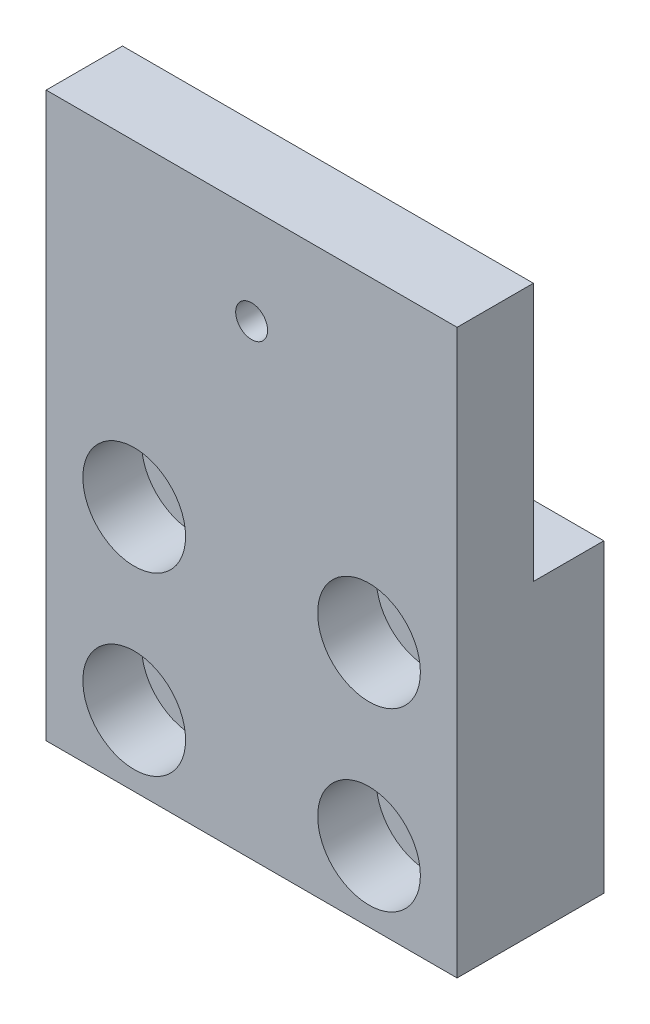
ISO-10303-21;
HEADER;
FILE_DESCRIPTION(('STEP AP214'),'2;1');
FILE_NAME('part.step','',(''),(''),'','','');
FILE_SCHEMA(('AUTOMOTIVE_DESIGN { 1 0 10303 214 1 1 1 1 }'));
ENDSEC;
DATA;
#1=APPLICATION_CONTEXT('core data for automotive mechanical design processes');
#2=APPLICATION_PROTOCOL_DEFINITION('international standard','automotive_design',2000,#1);
#3=PRODUCT_CONTEXT('',#1,'mechanical');
#4=PRODUCT('Part','Part','',(#3));
#5=PRODUCT_RELATED_PRODUCT_CATEGORY('part','',(#4));
#6=PRODUCT_DEFINITION_FORMATION('','',#4);
#7=PRODUCT_DEFINITION_CONTEXT('part definition',#1,'design');
#8=PRODUCT_DEFINITION('design','',#6,#7);
#9=PRODUCT_DEFINITION_SHAPE('','',#8);
#10=(LENGTH_UNIT() NAMED_UNIT(*) SI_UNIT(.MILLI.,.METRE.));
#11=(NAMED_UNIT(*) PLANE_ANGLE_UNIT() SI_UNIT($,.RADIAN.));
#12=(NAMED_UNIT(*) SI_UNIT($,.STERADIAN.) SOLID_ANGLE_UNIT());
#13=UNCERTAINTY_MEASURE_WITH_UNIT(LENGTH_MEASURE(1.E-05),#10,'distance_accuracy_value','');
#14=(GEOMETRIC_REPRESENTATION_CONTEXT(3) GLOBAL_UNCERTAINTY_ASSIGNED_CONTEXT((#13)) GLOBAL_UNIT_ASSIGNED_CONTEXT((#10,
#11,#12)) REPRESENTATION_CONTEXT('',''));
#15=CARTESIAN_POINT('',(0.,0.,0.));
#16=DIRECTION('',(0.,0.,1.));
#17=DIRECTION('',(1.,0.,0.));
#18=AXIS2_PLACEMENT_3D('',#15,#16,#17);
#19=CARTESIAN_POINT('',(-22.225,30.48,7.9375));
#20=DIRECTION('',(1.,0.,0.));
#21=DIRECTION('',(0.,1.,0.));
#22=AXIS2_PLACEMENT_3D('',#19,#20,#21);
#23=PLANE('',#22);
#24=DIRECTION('',(0.,-1.,0.));
#25=VECTOR('',#24,1.);
#26=CARTESIAN_POINT('',(-22.225,30.48,-0.317500000000002));
#27=LINE('',#26,#25);
#28=CARTESIAN_POINT('',(-22.225,30.48,-0.317500000000002));
#29=VERTEX_POINT('',#28);
#30=CARTESIAN_POINT('',(-22.225,2.53999999999998,-0.317500000000006));
#31=VERTEX_POINT('',#30);
#32=EDGE_CURVE('E93',#29,#31,#27,.T.);
#33=ORIENTED_EDGE('',*,*,#32,.T.);
#34=DIRECTION('',(0.,0.,-1.));
#35=VECTOR('',#34,1.);
#36=CARTESIAN_POINT('',(-22.225,2.53999999999998,-7.93750000000001));
#37=LINE('',#36,#35);
#38=CARTESIAN_POINT('',(-22.225,2.53999999999998,-7.93750000000001));
#39=VERTEX_POINT('',#38);
#40=EDGE_CURVE('E104',#31,#39,#37,.T.);
#41=ORIENTED_EDGE('',*,*,#40,.T.);
#42=DIRECTION('',(0.,-1.,0.));
#43=VECTOR('',#42,1.);
#44=CARTESIAN_POINT('',(-22.225,30.48,-7.9375));
#45=LINE('',#44,#43);
#46=CARTESIAN_POINT('',(-22.225,-30.48,-7.9375));
#47=VERTEX_POINT('',#46);
#48=EDGE_CURVE('E133',#39,#47,#45,.T.);
#49=ORIENTED_EDGE('',*,*,#48,.T.);
#50=DIRECTION('',(0.,0.,-1.));
#51=VECTOR('',#50,1.);
#52=CARTESIAN_POINT('',(-22.225,-30.48,7.9375));
#53=LINE('',#52,#51);
#54=CARTESIAN_POINT('',(-22.225,-30.48,7.9375));
#55=VERTEX_POINT('',#54);
#56=EDGE_CURVE('E11',#55,#47,#53,.T.);
#57=ORIENTED_EDGE('',*,*,#56,.F.);
#58=DIRECTION('',(0.,-1.,0.));
#59=VECTOR('',#58,1.);
#60=CARTESIAN_POINT('',(-22.225,30.48,7.9375));
#61=LINE('',#60,#59);
#62=CARTESIAN_POINT('',(-22.225,30.48,7.9375));
#63=VERTEX_POINT('',#62);
#64=EDGE_CURVE('E115',#63,#55,#61,.T.);
#65=ORIENTED_EDGE('',*,*,#64,.F.);
#66=DIRECTION('',(0.,0.,-1.));
#67=VECTOR('',#66,1.);
#68=CARTESIAN_POINT('',(-22.225,30.48,7.9375));
#69=LINE('',#68,#67);
#70=EDGE_CURVE('E109',#63,#29,#69,.T.);
#71=ORIENTED_EDGE('',*,*,#70,.T.);
#72=EDGE_LOOP('',(#33,#41,#49,#57,#65,#71));
#73=FACE_BOUND('',#72,.T.);
#74=ADVANCED_FACE('F35',(#73),#23,.F.);
#75=CARTESIAN_POINT('',(-22.225,-30.48,7.9375));
#76=DIRECTION('',(0.,1.,0.));
#77=DIRECTION('',(0.,0.,1.));
#78=AXIS2_PLACEMENT_3D('',#75,#76,#77);
#79=PLANE('',#78);
#80=DIRECTION('',(1.,0.,0.));
#81=VECTOR('',#80,1.);
#82=CARTESIAN_POINT('',(-22.225,-30.48,-7.9375));
#83=LINE('',#82,#81);
#84=CARTESIAN_POINT('',(22.225,-30.48,-7.9375));
#85=VERTEX_POINT('',#84);
#86=EDGE_CURVE('E73',#47,#85,#83,.T.);
#87=ORIENTED_EDGE('',*,*,#86,.T.);
#88=DIRECTION('',(0.,0.,-1.));
#89=VECTOR('',#88,1.);
#90=CARTESIAN_POINT('',(22.225,-30.48,7.9375));
#91=LINE('',#90,#89);
#92=CARTESIAN_POINT('',(22.225,-30.48,7.9375));
#93=VERTEX_POINT('',#92);
#94=EDGE_CURVE('E42',#93,#85,#91,.T.);
#95=ORIENTED_EDGE('',*,*,#94,.F.);
#96=DIRECTION('',(1.,0.,0.));
#97=VECTOR('',#96,1.);
#98=CARTESIAN_POINT('',(-22.225,-30.48,7.9375));
#99=LINE('',#98,#97);
#100=EDGE_CURVE('E78',#55,#93,#99,.T.);
#101=ORIENTED_EDGE('',*,*,#100,.F.);
#102=ORIENTED_EDGE('',*,*,#56,.T.);
#103=EDGE_LOOP('',(#87,#95,#101,#102));
#104=FACE_BOUND('',#103,.T.);
#105=ADVANCED_FACE('F213',(#104),#79,.F.);
#106=CARTESIAN_POINT('',(22.225,30.48,7.9375));
#107=DIRECTION('',(-1.,0.,0.));
#108=DIRECTION('',(0.,-1.,0.));
#109=AXIS2_PLACEMENT_3D('',#106,#107,#108);
#110=PLANE('',#109);
#111=DIRECTION('',(0.,1.,0.));
#112=VECTOR('',#111,1.);
#113=CARTESIAN_POINT('',(22.225,30.48,-7.9375));
#114=LINE('',#113,#112);
#115=CARTESIAN_POINT('',(22.225,2.54,-7.9375));
#116=VERTEX_POINT('',#115);
#117=EDGE_CURVE('E121',#85,#116,#114,.T.);
#118=ORIENTED_EDGE('',*,*,#117,.T.);
#119=DIRECTION('',(0.,0.,-1.));
#120=VECTOR('',#119,1.);
#121=CARTESIAN_POINT('',(22.225,2.53999999999999,-7.93750000000001));
#122=LINE('',#121,#120);
#123=CARTESIAN_POINT('',(22.225,2.53999999999999,-0.317500000000006));
#124=VERTEX_POINT('',#123);
#125=EDGE_CURVE('E49',#124,#116,#122,.T.);
#126=ORIENTED_EDGE('',*,*,#125,.F.);
#127=DIRECTION('',(0.,-1.,0.));
#128=VECTOR('',#127,1.);
#129=CARTESIAN_POINT('',(22.225,30.48,-0.317500000000002));
#130=LINE('',#129,#128);
#131=CARTESIAN_POINT('',(22.225,30.48,-0.317500000000002));
#132=VERTEX_POINT('',#131);
#133=EDGE_CURVE('E189',#132,#124,#130,.T.);
#134=ORIENTED_EDGE('',*,*,#133,.F.);
#135=DIRECTION('',(0.,0.,-1.));
#136=VECTOR('',#135,1.);
#137=CARTESIAN_POINT('',(22.225,30.48,7.9375));
#138=LINE('',#137,#136);
#139=CARTESIAN_POINT('',(22.225,30.48,7.9375));
#140=VERTEX_POINT('',#139);
#141=EDGE_CURVE('E112',#140,#132,#138,.T.);
#142=ORIENTED_EDGE('',*,*,#141,.F.);
#143=DIRECTION('',(0.,1.,0.));
#144=VECTOR('',#143,1.);
#145=CARTESIAN_POINT('',(22.225,30.48,7.9375));
#146=LINE('',#145,#144);
#147=EDGE_CURVE('E118',#93,#140,#146,.T.);
#148=ORIENTED_EDGE('',*,*,#147,.F.);
#149=ORIENTED_EDGE('',*,*,#94,.T.);
#150=EDGE_LOOP('',(#118,#126,#134,#142,#148,#149));
#151=FACE_BOUND('',#150,.T.);
#152=ADVANCED_FACE('F127',(#151),#110,.F.);
#153=CARTESIAN_POINT('',(-22.225,30.48,7.9375));
#154=DIRECTION('',(0.,-1.,0.));
#155=DIRECTION('',(0.,0.,-1.));
#156=AXIS2_PLACEMENT_3D('',#153,#154,#155);
#157=PLANE('',#156);
#158=ORIENTED_EDGE('',*,*,#141,.T.);
#159=DIRECTION('',(1.,0.,0.));
#160=VECTOR('',#159,1.);
#161=CARTESIAN_POINT('',(-22.225,30.48,-0.317500000000002));
#162=LINE('',#161,#160);
#163=EDGE_CURVE('E97',#29,#132,#162,.T.);
#164=ORIENTED_EDGE('',*,*,#163,.F.);
#165=ORIENTED_EDGE('',*,*,#70,.F.);
#166=DIRECTION('',(-1.,0.,0.));
#167=VECTOR('',#166,1.);
#168=CARTESIAN_POINT('',(-22.225,30.48,7.9375));
#169=LINE('',#168,#167);
#170=EDGE_CURVE('E58',#140,#63,#169,.T.);
#171=ORIENTED_EDGE('',*,*,#170,.F.);
#172=EDGE_LOOP('',(#158,#164,#165,#171));
#173=FACE_BOUND('',#172,.T.);
#174=ADVANCED_FACE('F108',(#173),#157,.F.);
#175=CARTESIAN_POINT('',(0.,0.,7.9375));
#176=DIRECTION('',(0.,0.,1.));
#177=DIRECTION('',(1.,0.,0.));
#178=AXIS2_PLACEMENT_3D('',#175,#176,#177);
#179=PLANE('',#178);
#180=CARTESIAN_POINT('',(0.,19.939,7.9375));
#181=DIRECTION('',(0.,0.,1.));
#182=DIRECTION('',(1.,0.,0.));
#183=AXIS2_PLACEMENT_3D('',#180,#181,#182);
#184=CIRCLE('',#183,1.72719999999999);
#185=CARTESIAN_POINT('',(1.72719999999999,19.939,7.9375));
#186=VERTEX_POINT('',#185);
#187=EDGE_CURVE('E195',#186,#186,#184,.T.);
#188=ORIENTED_EDGE('',*,*,#187,.F.);
#189=EDGE_LOOP('',(#188));
#190=FACE_BOUND('',#189,.T.);
#191=CARTESIAN_POINT('',(-12.7,-3.81,7.9375));
#192=DIRECTION('',(0.,0.,1.));
#193=DIRECTION('',(1.,0.,0.));
#194=AXIS2_PLACEMENT_3D('',#191,#192,#193);
#195=CIRCLE('',#194,5.55625);
#196=CARTESIAN_POINT('',(-7.14375,-3.81,7.9375));
#197=VERTEX_POINT('',#196);
#198=EDGE_CURVE('E183',#197,#197,#195,.T.);
#199=ORIENTED_EDGE('',*,*,#198,.F.);
#200=EDGE_LOOP('',(#199));
#201=FACE_BOUND('',#200,.T.);
#202=CARTESIAN_POINT('',(12.7,-3.81,7.9375));
#203=DIRECTION('',(0.,0.,1.));
#204=DIRECTION('',(1.,0.,0.));
#205=AXIS2_PLACEMENT_3D('',#202,#203,#204);
#206=CIRCLE('',#205,5.55625);
#207=CARTESIAN_POINT('',(18.25625,-3.81,7.9375));
#208=VERTEX_POINT('',#207);
#209=EDGE_CURVE('E171',#208,#208,#206,.T.);
#210=ORIENTED_EDGE('',*,*,#209,.F.);
#211=EDGE_LOOP('',(#210));
#212=FACE_BOUND('',#211,.T.);
#213=CARTESIAN_POINT('',(12.7,-22.86,7.9375));
#214=DIRECTION('',(0.,0.,1.));
#215=DIRECTION('',(1.,0.,0.));
#216=AXIS2_PLACEMENT_3D('',#213,#214,#215);
#217=CIRCLE('',#216,5.55625);
#218=CARTESIAN_POINT('',(18.25625,-22.86,7.9375));
#219=VERTEX_POINT('',#218);
#220=EDGE_CURVE('E159',#219,#219,#217,.T.);
#221=ORIENTED_EDGE('',*,*,#220,.F.);
#222=EDGE_LOOP('',(#221));
#223=FACE_BOUND('',#222,.T.);
#224=CARTESIAN_POINT('',(-12.7,-22.86,7.9375));
#225=DIRECTION('',(0.,0.,1.));
#226=DIRECTION('',(1.,0.,0.));
#227=AXIS2_PLACEMENT_3D('',#224,#225,#226);
#228=CIRCLE('',#227,5.55625);
#229=CARTESIAN_POINT('',(-7.14375,-22.86,7.9375));
#230=VERTEX_POINT('',#229);
#231=EDGE_CURVE('E147',#230,#230,#228,.T.);
#232=ORIENTED_EDGE('',*,*,#231,.F.);
#233=EDGE_LOOP('',(#232));
#234=FACE_BOUND('',#233,.T.);
#235=ORIENTED_EDGE('',*,*,#64,.T.);
#236=ORIENTED_EDGE('',*,*,#100,.T.);
#237=ORIENTED_EDGE('',*,*,#147,.T.);
#238=ORIENTED_EDGE('',*,*,#170,.T.);
#239=EDGE_LOOP('',(#235,#236,#237,#238));
#240=FACE_BOUND('',#239,.T.);
#241=ADVANCED_FACE('F202',(#190,#201,#212,#223,#234,#240),#179,.T.);
#242=CARTESIAN_POINT('',(0.,0.,-7.9375));
#243=DIRECTION('',(0.,0.,1.));
#244=DIRECTION('',(1.,0.,0.));
#245=AXIS2_PLACEMENT_3D('',#242,#243,#244);
#246=PLANE('',#245);
#247=CARTESIAN_POINT('',(-12.7,-3.81,-7.9375));
#248=DIRECTION('',(0.,0.,1.));
#249=DIRECTION('',(1.,0.,0.));
#250=AXIS2_PLACEMENT_3D('',#247,#248,#249);
#251=CIRCLE('',#250,3.3782);
#252=CARTESIAN_POINT('',(-9.3218,-3.81,-7.9375));
#253=VERTEX_POINT('',#252);
#254=EDGE_CURVE('E174',#253,#253,#251,.T.);
#255=ORIENTED_EDGE('',*,*,#254,.T.);
#256=EDGE_LOOP('',(#255));
#257=FACE_BOUND('',#256,.T.);
#258=CARTESIAN_POINT('',(12.7,-3.81,-7.9375));
#259=DIRECTION('',(0.,0.,1.));
#260=DIRECTION('',(1.,0.,0.));
#261=AXIS2_PLACEMENT_3D('',#258,#259,#260);
#262=CIRCLE('',#261,3.3782);
#263=CARTESIAN_POINT('',(16.0782,-3.81,-7.9375));
#264=VERTEX_POINT('',#263);
#265=EDGE_CURVE('E162',#264,#264,#262,.T.);
#266=ORIENTED_EDGE('',*,*,#265,.T.);
#267=EDGE_LOOP('',(#266));
#268=FACE_BOUND('',#267,.T.);
#269=CARTESIAN_POINT('',(12.7,-22.86,-7.9375));
#270=DIRECTION('',(0.,0.,1.));
#271=DIRECTION('',(1.,0.,0.));
#272=AXIS2_PLACEMENT_3D('',#269,#270,#271);
#273=CIRCLE('',#272,3.3782);
#274=CARTESIAN_POINT('',(16.0782,-22.86,-7.9375));
#275=VERTEX_POINT('',#274);
#276=EDGE_CURVE('E150',#275,#275,#273,.T.);
#277=ORIENTED_EDGE('',*,*,#276,.T.);
#278=EDGE_LOOP('',(#277));
#279=FACE_BOUND('',#278,.T.);
#280=CARTESIAN_POINT('',(-12.7,-22.86,-7.9375));
#281=DIRECTION('',(0.,0.,1.));
#282=DIRECTION('',(1.,0.,0.));
#283=AXIS2_PLACEMENT_3D('',#280,#281,#282);
#284=CIRCLE('',#283,3.3782);
#285=CARTESIAN_POINT('',(-9.32179999999999,-22.86,-7.9375));
#286=VERTEX_POINT('',#285);
#287=EDGE_CURVE('E134',#286,#286,#284,.T.);
#288=ORIENTED_EDGE('',*,*,#287,.T.);
#289=EDGE_LOOP('',(#288));
#290=FACE_BOUND('',#289,.T.);
#291=ORIENTED_EDGE('',*,*,#48,.F.);
#292=DIRECTION('',(1.,0.,0.));
#293=VECTOR('',#292,1.);
#294=CARTESIAN_POINT('',(-22.225,2.53999999999998,-7.93750000000001));
#295=LINE('',#294,#293);
#296=EDGE_CURVE('E131',#39,#116,#295,.T.);
#297=ORIENTED_EDGE('',*,*,#296,.T.);
#298=ORIENTED_EDGE('',*,*,#117,.F.);
#299=ORIENTED_EDGE('',*,*,#86,.F.);
#300=EDGE_LOOP('',(#291,#297,#298,#299));
#301=FACE_BOUND('',#300,.T.);
#302=ADVANCED_FACE('F130',(#257,#268,#279,#290,#301),#246,.F.);
#303=CARTESIAN_POINT('',(-12.7,-22.86,7.9375));
#304=DIRECTION('',(0.,0.,1.));
#305=DIRECTION('',(1.,0.,0.));
#306=AXIS2_PLACEMENT_3D('',#303,#304,#305);
#307=CYLINDRICAL_SURFACE('',#306,3.3782);
#308=ORIENTED_EDGE('',*,*,#287,.F.);
#309=EDGE_LOOP('',(#308));
#310=FACE_BOUND('',#309,.T.);
#311=CARTESIAN_POINT('',(-12.7,-22.86,1.5875));
#312=DIRECTION('',(0.,0.,1.));
#313=DIRECTION('',(1.,0.,0.));
#314=AXIS2_PLACEMENT_3D('',#311,#312,#313);
#315=CIRCLE('',#314,3.37820000000001);
#316=CARTESIAN_POINT('',(-9.32179999999999,-22.86,1.5875));
#317=VERTEX_POINT('',#316);
#318=EDGE_CURVE('E141',#317,#317,#315,.T.);
#319=ORIENTED_EDGE('',*,*,#318,.T.);
#320=EDGE_LOOP('',(#319));
#321=FACE_BOUND('',#320,.T.);
#322=ADVANCED_FACE('F224',(#310,#321),#307,.F.);
#323=CARTESIAN_POINT('',(-9.32179999999999,-22.86,1.5875));
#324=DIRECTION('',(0.,0.,-1.));
#325=DIRECTION('',(-1.,0.,0.));
#326=AXIS2_PLACEMENT_3D('',#323,#324,#325);
#327=PLANE('',#326);
#328=ORIENTED_EDGE('',*,*,#318,.F.);
#329=EDGE_LOOP('',(#328));
#330=FACE_BOUND('',#329,.T.);
#331=CARTESIAN_POINT('',(-12.7,-22.86,1.5875));
#332=DIRECTION('',(0.,0.,1.));
#333=DIRECTION('',(1.,0.,0.));
#334=AXIS2_PLACEMENT_3D('',#331,#332,#333);
#335=CIRCLE('',#334,5.55625);
#336=CARTESIAN_POINT('',(-7.14375,-22.86,1.5875));
#337=VERTEX_POINT('',#336);
#338=EDGE_CURVE('E144',#337,#337,#335,.T.);
#339=ORIENTED_EDGE('',*,*,#338,.T.);
#340=EDGE_LOOP('',(#339));
#341=FACE_BOUND('',#340,.T.);
#342=ADVANCED_FACE('F229',(#330,#341),#327,.F.);
#343=CARTESIAN_POINT('',(-12.7,-22.86,7.9375));
#344=DIRECTION('',(0.,0.,1.));
#345=DIRECTION('',(1.,0.,0.));
#346=AXIS2_PLACEMENT_3D('',#343,#344,#345);
#347=CYLINDRICAL_SURFACE('',#346,5.55625);
#348=ORIENTED_EDGE('',*,*,#338,.F.);
#349=EDGE_LOOP('',(#348));
#350=FACE_BOUND('',#349,.T.);
#351=ORIENTED_EDGE('',*,*,#231,.T.);
#352=EDGE_LOOP('',(#351));
#353=FACE_BOUND('',#352,.T.);
#354=ADVANCED_FACE('F233',(#350,#353),#347,.F.);
#355=CARTESIAN_POINT('',(12.7,-22.86,7.9375));
#356=DIRECTION('',(0.,0.,1.));
#357=DIRECTION('',(1.,0.,0.));
#358=AXIS2_PLACEMENT_3D('',#355,#356,#357);
#359=CYLINDRICAL_SURFACE('',#358,3.37820000000001);
#360=ORIENTED_EDGE('',*,*,#276,.F.);
#361=EDGE_LOOP('',(#360));
#362=FACE_BOUND('',#361,.T.);
#363=CARTESIAN_POINT('',(12.7,-22.86,1.5875));
#364=DIRECTION('',(0.,0.,1.));
#365=DIRECTION('',(1.,0.,0.));
#366=AXIS2_PLACEMENT_3D('',#363,#364,#365);
#367=CIRCLE('',#366,3.37820000000001);
#368=CARTESIAN_POINT('',(16.0782,-22.86,1.5875));
#369=VERTEX_POINT('',#368);
#370=EDGE_CURVE('E153',#369,#369,#367,.T.);
#371=ORIENTED_EDGE('',*,*,#370,.T.);
#372=EDGE_LOOP('',(#371));
#373=FACE_BOUND('',#372,.T.);
#374=ADVANCED_FACE('F237',(#362,#373),#359,.F.);
#375=CARTESIAN_POINT('',(16.0782,-22.86,1.5875));
#376=DIRECTION('',(0.,0.,-1.));
#377=DIRECTION('',(-1.,0.,0.));
#378=AXIS2_PLACEMENT_3D('',#375,#376,#377);
#379=PLANE('',#378);
#380=ORIENTED_EDGE('',*,*,#370,.F.);
#381=EDGE_LOOP('',(#380));
#382=FACE_BOUND('',#381,.T.);
#383=CARTESIAN_POINT('',(12.7,-22.86,1.5875));
#384=DIRECTION('',(0.,0.,1.));
#385=DIRECTION('',(1.,0.,0.));
#386=AXIS2_PLACEMENT_3D('',#383,#384,#385);
#387=CIRCLE('',#386,5.55625);
#388=CARTESIAN_POINT('',(18.25625,-22.86,1.5875));
#389=VERTEX_POINT('',#388);
#390=EDGE_CURVE('E156',#389,#389,#387,.T.);
#391=ORIENTED_EDGE('',*,*,#390,.T.);
#392=EDGE_LOOP('',(#391));
#393=FACE_BOUND('',#392,.T.);
#394=ADVANCED_FACE('F241',(#382,#393),#379,.F.);
#395=CARTESIAN_POINT('',(12.7,-22.86,7.9375));
#396=DIRECTION('',(0.,0.,1.));
#397=DIRECTION('',(1.,0.,0.));
#398=AXIS2_PLACEMENT_3D('',#395,#396,#397);
#399=CYLINDRICAL_SURFACE('',#398,5.55625);
#400=ORIENTED_EDGE('',*,*,#390,.F.);
#401=EDGE_LOOP('',(#400));
#402=FACE_BOUND('',#401,.T.);
#403=ORIENTED_EDGE('',*,*,#220,.T.);
#404=EDGE_LOOP('',(#403));
#405=FACE_BOUND('',#404,.T.);
#406=ADVANCED_FACE('F245',(#402,#405),#399,.F.);
#407=CARTESIAN_POINT('',(12.7,-3.81,7.9375));
#408=DIRECTION('',(0.,0.,1.));
#409=DIRECTION('',(1.,0.,0.));
#410=AXIS2_PLACEMENT_3D('',#407,#408,#409);
#411=CYLINDRICAL_SURFACE('',#410,3.37820000000001);
#412=ORIENTED_EDGE('',*,*,#265,.F.);
#413=EDGE_LOOP('',(#412));
#414=FACE_BOUND('',#413,.T.);
#415=CARTESIAN_POINT('',(12.7,-3.81,1.5875));
#416=DIRECTION('',(0.,0.,1.));
#417=DIRECTION('',(1.,0.,0.));
#418=AXIS2_PLACEMENT_3D('',#415,#416,#417);
#419=CIRCLE('',#418,3.37820000000001);
#420=CARTESIAN_POINT('',(16.0782,-3.81,1.5875));
#421=VERTEX_POINT('',#420);
#422=EDGE_CURVE('E165',#421,#421,#419,.T.);
#423=ORIENTED_EDGE('',*,*,#422,.T.);
#424=EDGE_LOOP('',(#423));
#425=FACE_BOUND('',#424,.T.);
#426=ADVANCED_FACE('F249',(#414,#425),#411,.F.);
#427=CARTESIAN_POINT('',(16.0782,-3.81,1.5875));
#428=DIRECTION('',(0.,0.,-1.));
#429=DIRECTION('',(-1.,0.,0.));
#430=AXIS2_PLACEMENT_3D('',#427,#428,#429);
#431=PLANE('',#430);
#432=ORIENTED_EDGE('',*,*,#422,.F.);
#433=EDGE_LOOP('',(#432));
#434=FACE_BOUND('',#433,.T.);
#435=CARTESIAN_POINT('',(12.7,-3.81,1.5875));
#436=DIRECTION('',(0.,0.,1.));
#437=DIRECTION('',(1.,0.,0.));
#438=AXIS2_PLACEMENT_3D('',#435,#436,#437);
#439=CIRCLE('',#438,5.55625);
#440=CARTESIAN_POINT('',(18.25625,-3.81,1.5875));
#441=VERTEX_POINT('',#440);
#442=EDGE_CURVE('E168',#441,#441,#439,.T.);
#443=ORIENTED_EDGE('',*,*,#442,.T.);
#444=EDGE_LOOP('',(#443));
#445=FACE_BOUND('',#444,.T.);
#446=ADVANCED_FACE('F253',(#434,#445),#431,.F.);
#447=CARTESIAN_POINT('',(12.7,-3.81,7.9375));
#448=DIRECTION('',(0.,0.,1.));
#449=DIRECTION('',(1.,0.,0.));
#450=AXIS2_PLACEMENT_3D('',#447,#448,#449);
#451=CYLINDRICAL_SURFACE('',#450,5.55625);
#452=ORIENTED_EDGE('',*,*,#442,.F.);
#453=EDGE_LOOP('',(#452));
#454=FACE_BOUND('',#453,.T.);
#455=ORIENTED_EDGE('',*,*,#209,.T.);
#456=EDGE_LOOP('',(#455));
#457=FACE_BOUND('',#456,.T.);
#458=ADVANCED_FACE('F257',(#454,#457),#451,.F.);
#459=CARTESIAN_POINT('',(-12.7,-3.81,7.9375));
#460=DIRECTION('',(0.,0.,1.));
#461=DIRECTION('',(1.,0.,0.));
#462=AXIS2_PLACEMENT_3D('',#459,#460,#461);
#463=CYLINDRICAL_SURFACE('',#462,3.3782);
#464=ORIENTED_EDGE('',*,*,#254,.F.);
#465=EDGE_LOOP('',(#464));
#466=FACE_BOUND('',#465,.T.);
#467=CARTESIAN_POINT('',(-12.7,-3.81,1.5875));
#468=DIRECTION('',(0.,0.,1.));
#469=DIRECTION('',(1.,0.,0.));
#470=AXIS2_PLACEMENT_3D('',#467,#468,#469);
#471=CIRCLE('',#470,3.37820000000001);
#472=CARTESIAN_POINT('',(-9.32179999999999,-3.81,1.5875));
#473=VERTEX_POINT('',#472);
#474=EDGE_CURVE('E177',#473,#473,#471,.T.);
#475=ORIENTED_EDGE('',*,*,#474,.T.);
#476=EDGE_LOOP('',(#475));
#477=FACE_BOUND('',#476,.T.);
#478=ADVANCED_FACE('F261',(#466,#477),#463,.F.);
#479=CARTESIAN_POINT('',(-9.32179999999999,-3.81,1.5875));
#480=DIRECTION('',(0.,0.,-1.));
#481=DIRECTION('',(-1.,0.,0.));
#482=AXIS2_PLACEMENT_3D('',#479,#480,#481);
#483=PLANE('',#482);
#484=ORIENTED_EDGE('',*,*,#474,.F.);
#485=EDGE_LOOP('',(#484));
#486=FACE_BOUND('',#485,.T.);
#487=CARTESIAN_POINT('',(-12.7,-3.81,1.5875));
#488=DIRECTION('',(0.,0.,1.));
#489=DIRECTION('',(1.,0.,0.));
#490=AXIS2_PLACEMENT_3D('',#487,#488,#489);
#491=CIRCLE('',#490,5.55625);
#492=CARTESIAN_POINT('',(-7.14375,-3.81,1.5875));
#493=VERTEX_POINT('',#492);
#494=EDGE_CURVE('E180',#493,#493,#491,.T.);
#495=ORIENTED_EDGE('',*,*,#494,.T.);
#496=EDGE_LOOP('',(#495));
#497=FACE_BOUND('',#496,.T.);
#498=ADVANCED_FACE('F265',(#486,#497),#483,.F.);
#499=CARTESIAN_POINT('',(-12.7,-3.81,7.9375));
#500=DIRECTION('',(0.,0.,1.));
#501=DIRECTION('',(1.,0.,0.));
#502=AXIS2_PLACEMENT_3D('',#499,#500,#501);
#503=CYLINDRICAL_SURFACE('',#502,5.55625);
#504=ORIENTED_EDGE('',*,*,#494,.F.);
#505=EDGE_LOOP('',(#504));
#506=FACE_BOUND('',#505,.T.);
#507=ORIENTED_EDGE('',*,*,#198,.T.);
#508=EDGE_LOOP('',(#507));
#509=FACE_BOUND('',#508,.T.);
#510=ADVANCED_FACE('F269',(#506,#509),#503,.F.);
#511=CARTESIAN_POINT('',(-22.225,2.53999999999998,-7.93750000000001));
#512=DIRECTION('',(0.,-1.,0.));
#513=DIRECTION('',(1.,0.,0.));
#514=AXIS2_PLACEMENT_3D('',#511,#512,#513);
#515=PLANE('',#514);
#516=ORIENTED_EDGE('',*,*,#125,.T.);
#517=ORIENTED_EDGE('',*,*,#296,.F.);
#518=ORIENTED_EDGE('',*,*,#40,.F.);
#519=DIRECTION('',(1.,0.,0.));
#520=VECTOR('',#519,1.);
#521=CARTESIAN_POINT('',(-22.225,2.53999999999998,-0.317500000000006));
#522=LINE('',#521,#520);
#523=EDGE_CURVE('E99',#31,#124,#522,.T.);
#524=ORIENTED_EDGE('',*,*,#523,.T.);
#525=EDGE_LOOP('',(#516,#517,#518,#524));
#526=FACE_BOUND('',#525,.T.);
#527=ADVANCED_FACE('F273',(#526),#515,.F.);
#528=CARTESIAN_POINT('',(-22.225,30.48,-0.317500000000002));
#529=DIRECTION('',(0.,0.,1.));
#530=DIRECTION('',(0.,-1.,0.));
#531=AXIS2_PLACEMENT_3D('',#528,#529,#530);
#532=PLANE('',#531);
#533=CARTESIAN_POINT('',(0.,19.939,-0.317500000000004));
#534=DIRECTION('',(0.,0.,1.));
#535=DIRECTION('',(0.,-1.,0.));
#536=AXIS2_PLACEMENT_3D('',#533,#534,#535);
#537=CIRCLE('',#536,1.72719999999999);
#538=CARTESIAN_POINT('',(0.,18.2118,-0.317500000000004));
#539=VERTEX_POINT('',#538);
#540=EDGE_CURVE('E191',#539,#539,#537,.T.);
#541=ORIENTED_EDGE('',*,*,#540,.T.);
#542=EDGE_LOOP('',(#541));
#543=FACE_BOUND('',#542,.T.);
#544=ORIENTED_EDGE('',*,*,#133,.T.);
#545=ORIENTED_EDGE('',*,*,#523,.F.);
#546=ORIENTED_EDGE('',*,*,#32,.F.);
#547=ORIENTED_EDGE('',*,*,#163,.T.);
#548=EDGE_LOOP('',(#544,#545,#546,#547));
#549=FACE_BOUND('',#548,.T.);
#550=ADVANCED_FACE('F96',(#543,#549),#532,.F.);
#551=CARTESIAN_POINT('',(0.,19.939,7.9375));
#552=DIRECTION('',(0.,0.,1.));
#553=DIRECTION('',(1.,0.,0.));
#554=AXIS2_PLACEMENT_3D('',#551,#552,#553);
#555=CYLINDRICAL_SURFACE('',#554,1.72719999999999);
#556=ORIENTED_EDGE('',*,*,#187,.T.);
#557=EDGE_LOOP('',(#556));
#558=FACE_BOUND('',#557,.T.);
#559=ORIENTED_EDGE('',*,*,#540,.F.);
#560=EDGE_LOOP('',(#559));
#561=FACE_BOUND('',#560,.T.);
#562=ADVANCED_FACE('F199',(#558,#561),#555,.F.);
#563=CLOSED_SHELL('',(#74,#105,#152,#174,#241,#302,#322,#342,#354,#374,#394,#406,#426,#446,#458,
#478,#498,#510,#527,#550,#562));
#564=MANIFOLD_SOLID_BREP('B2',#563);
#565=ADVANCED_BREP_SHAPE_REPRESENTATION('',(#18,#564),#14);
#566=SHAPE_DEFINITION_REPRESENTATION(#9,#565);
ENDSEC;
END-ISO-10303-21;
